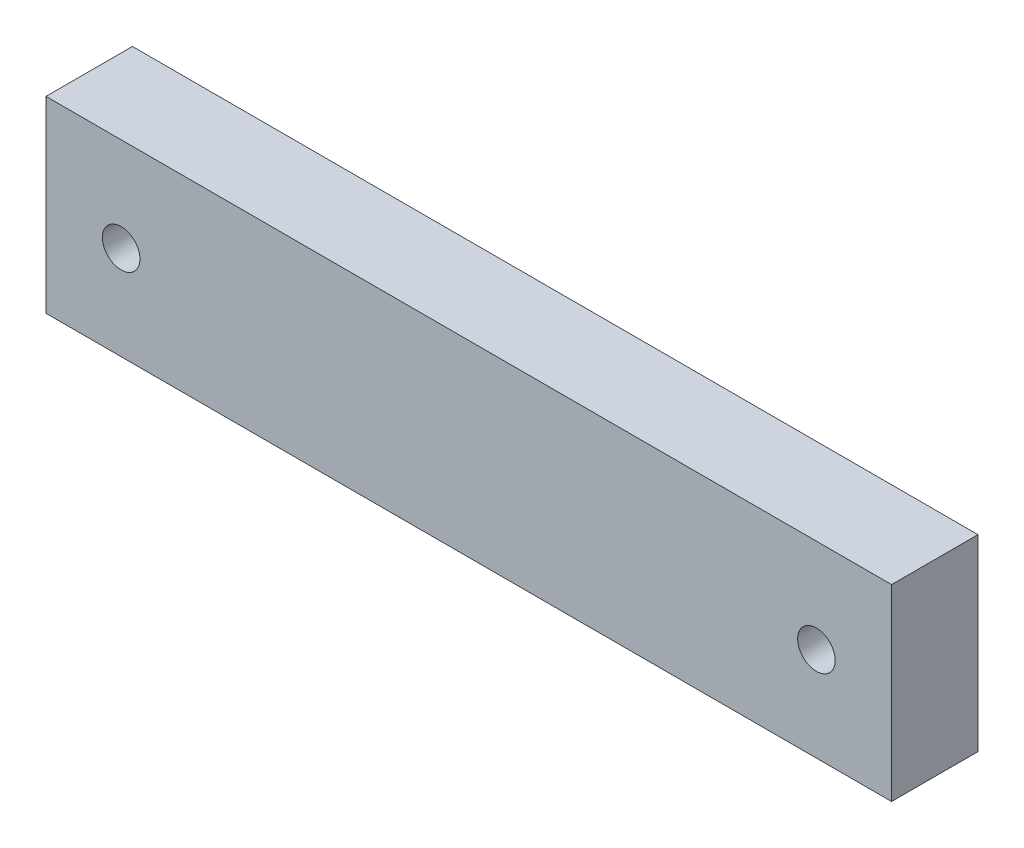
ISO-10303-21;
HEADER;
FILE_DESCRIPTION(('STEP AP214'),'2;1');
FILE_NAME('part.step','',(''),(''),'','','');
FILE_SCHEMA(('AUTOMOTIVE_DESIGN { 1 0 10303 214 1 1 1 1 }'));
ENDSEC;
DATA;
#1=APPLICATION_CONTEXT('core data for automotive mechanical design processes');
#2=APPLICATION_PROTOCOL_DEFINITION('international standard','automotive_design',2000,#1);
#3=PRODUCT_CONTEXT('',#1,'mechanical');
#4=PRODUCT('Part','Part','',(#3));
#5=PRODUCT_RELATED_PRODUCT_CATEGORY('part','',(#4));
#6=PRODUCT_DEFINITION_FORMATION('','',#4);
#7=PRODUCT_DEFINITION_CONTEXT('part definition',#1,'design');
#8=PRODUCT_DEFINITION('design','',#6,#7);
#9=PRODUCT_DEFINITION_SHAPE('','',#8);
#10=(LENGTH_UNIT() NAMED_UNIT(*) SI_UNIT(.MILLI.,.METRE.));
#11=(NAMED_UNIT(*) PLANE_ANGLE_UNIT() SI_UNIT($,.RADIAN.));
#12=(NAMED_UNIT(*) SI_UNIT($,.STERADIAN.) SOLID_ANGLE_UNIT());
#13=UNCERTAINTY_MEASURE_WITH_UNIT(LENGTH_MEASURE(1.E-05),#10,'distance_accuracy_value','');
#14=(GEOMETRIC_REPRESENTATION_CONTEXT(3) GLOBAL_UNCERTAINTY_ASSIGNED_CONTEXT((#13)) GLOBAL_UNIT_ASSIGNED_CONTEXT((#10,
#11,#12)) REPRESENTATION_CONTEXT('',''));
#15=CARTESIAN_POINT('',(0.,0.,0.));
#16=DIRECTION('',(0.,0.,1.));
#17=DIRECTION('',(1.,0.,0.));
#18=AXIS2_PLACEMENT_3D('',#15,#16,#17);
#19=CARTESIAN_POINT('',(0.,0.,23.));
#20=DIRECTION('',(0.,0.,1.));
#21=DIRECTION('',(1.,0.,0.));
#22=AXIS2_PLACEMENT_3D('',#19,#20,#21);
#23=PLANE('',#22);
#24=CARTESIAN_POINT('',(92.5,0.,23.));
#25=DIRECTION('',(0.,0.,1.));
#26=DIRECTION('',(1.,0.,0.));
#27=AXIS2_PLACEMENT_3D('',#24,#25,#26);
#28=CIRCLE('',#27,5.);
#29=CARTESIAN_POINT('',(97.5,0.,23.));
#30=VERTEX_POINT('',#29);
#31=EDGE_CURVE('E99',#30,#30,#28,.T.);
#32=ORIENTED_EDGE('',*,*,#31,.F.);
#33=EDGE_LOOP('',(#32));
#34=FACE_BOUND('',#33,.T.);
#35=DIRECTION('',(0.,1.,0.));
#36=VECTOR('',#35,1.);
#37=CARTESIAN_POINT('',(112.5,25.,23.));
#38=LINE('',#37,#36);
#39=CARTESIAN_POINT('',(112.5,-25.,23.));
#40=VERTEX_POINT('',#39);
#41=CARTESIAN_POINT('',(112.5,25.,23.));
#42=VERTEX_POINT('',#41);
#43=EDGE_CURVE('E84',#40,#42,#38,.T.);
#44=ORIENTED_EDGE('',*,*,#43,.T.);
#45=DIRECTION('',(-1.,0.,0.));
#46=VECTOR('',#45,1.);
#47=CARTESIAN_POINT('',(-112.5,25.,23.));
#48=LINE('',#47,#46);
#49=CARTESIAN_POINT('',(-112.5,25.,23.));
#50=VERTEX_POINT('',#49);
#51=EDGE_CURVE('E79',#42,#50,#48,.T.);
#52=ORIENTED_EDGE('',*,*,#51,.T.);
#53=DIRECTION('',(0.,-1.,0.));
#54=VECTOR('',#53,1.);
#55=CARTESIAN_POINT('',(-112.5,25.,23.));
#56=LINE('',#55,#54);
#57=CARTESIAN_POINT('',(-112.5,-25.,23.));
#58=VERTEX_POINT('',#57);
#59=EDGE_CURVE('E82',#50,#58,#56,.T.);
#60=ORIENTED_EDGE('',*,*,#59,.T.);
#61=DIRECTION('',(1.,0.,0.));
#62=VECTOR('',#61,1.);
#63=CARTESIAN_POINT('',(-112.5,-25.,23.));
#64=LINE('',#63,#62);
#65=EDGE_CURVE('E49',#58,#40,#64,.T.);
#66=ORIENTED_EDGE('',*,*,#65,.T.);
#67=EDGE_LOOP('',(#44,#52,#60,#66));
#68=FACE_BOUND('',#67,.T.);
#69=CARTESIAN_POINT('',(-92.5,0.,23.));
#70=DIRECTION('',(0.,0.,1.));
#71=DIRECTION('',(1.,0.,0.));
#72=AXIS2_PLACEMENT_3D('',#69,#70,#71);
#73=CIRCLE('',#72,5.);
#74=CARTESIAN_POINT('',(-87.5,0.,23.));
#75=VERTEX_POINT('',#74);
#76=EDGE_CURVE('E114',#75,#75,#73,.T.);
#77=ORIENTED_EDGE('',*,*,#76,.F.);
#78=EDGE_LOOP('',(#77));
#79=FACE_BOUND('',#78,.T.);
#80=ADVANCED_FACE('F32',(#34,#68,#79),#23,.T.);
#81=CARTESIAN_POINT('',(0.,0.,0.));
#82=DIRECTION('',(0.,0.,1.));
#83=DIRECTION('',(1.,0.,0.));
#84=AXIS2_PLACEMENT_3D('',#81,#82,#83);
#85=PLANE('',#84);
#86=CARTESIAN_POINT('',(92.5,0.,0.));
#87=DIRECTION('',(0.,0.,1.));
#88=DIRECTION('',(1.,0.,0.));
#89=AXIS2_PLACEMENT_3D('',#86,#87,#88);
#90=CIRCLE('',#89,5.);
#91=CARTESIAN_POINT('',(97.5,0.,0.));
#92=VERTEX_POINT('',#91);
#93=EDGE_CURVE('E111',#92,#92,#90,.T.);
#94=ORIENTED_EDGE('',*,*,#93,.T.);
#95=EDGE_LOOP('',(#94));
#96=FACE_BOUND('',#95,.T.);
#97=DIRECTION('',(0.,1.,0.));
#98=VECTOR('',#97,1.);
#99=CARTESIAN_POINT('',(112.5,25.,0.));
#100=LINE('',#99,#98);
#101=CARTESIAN_POINT('',(112.5,-25.,0.));
#102=VERTEX_POINT('',#101);
#103=CARTESIAN_POINT('',(112.5,25.,0.));
#104=VERTEX_POINT('',#103);
#105=EDGE_CURVE('E96',#102,#104,#100,.T.);
#106=ORIENTED_EDGE('',*,*,#105,.F.);
#107=DIRECTION('',(1.,0.,0.));
#108=VECTOR('',#107,1.);
#109=CARTESIAN_POINT('',(-112.5,-25.,0.));
#110=LINE('',#109,#108);
#111=CARTESIAN_POINT('',(-112.5,-25.,0.));
#112=VERTEX_POINT('',#111);
#113=EDGE_CURVE('E72',#112,#102,#110,.T.);
#114=ORIENTED_EDGE('',*,*,#113,.F.);
#115=DIRECTION('',(0.,-1.,0.));
#116=VECTOR('',#115,1.);
#117=CARTESIAN_POINT('',(-112.5,25.,0.));
#118=LINE('',#117,#116);
#119=CARTESIAN_POINT('',(-112.5,25.,0.));
#120=VERTEX_POINT('',#119);
#121=EDGE_CURVE('E66',#120,#112,#118,.T.);
#122=ORIENTED_EDGE('',*,*,#121,.F.);
#123=DIRECTION('',(-1.,0.,0.));
#124=VECTOR('',#123,1.);
#125=CARTESIAN_POINT('',(-112.5,25.,0.));
#126=LINE('',#125,#124);
#127=EDGE_CURVE('E88',#104,#120,#126,.T.);
#128=ORIENTED_EDGE('',*,*,#127,.F.);
#129=EDGE_LOOP('',(#106,#114,#122,#128));
#130=FACE_BOUND('',#129,.T.);
#131=CARTESIAN_POINT('',(-92.5,0.,0.));
#132=DIRECTION('',(0.,0.,1.));
#133=DIRECTION('',(1.,0.,0.));
#134=AXIS2_PLACEMENT_3D('',#131,#132,#133);
#135=CIRCLE('',#134,5.);
#136=CARTESIAN_POINT('',(-87.5,0.,0.));
#137=VERTEX_POINT('',#136);
#138=EDGE_CURVE('E117',#137,#137,#135,.T.);
#139=ORIENTED_EDGE('',*,*,#138,.T.);
#140=EDGE_LOOP('',(#139));
#141=FACE_BOUND('',#140,.T.);
#142=ADVANCED_FACE('F107',(#96,#130,#141),#85,.F.);
#143=CARTESIAN_POINT('',(112.5,25.,23.));
#144=DIRECTION('',(-1.,0.,0.));
#145=DIRECTION('',(0.,0.,1.));
#146=AXIS2_PLACEMENT_3D('',#143,#144,#145);
#147=PLANE('',#146);
#148=ORIENTED_EDGE('',*,*,#105,.T.);
#149=DIRECTION('',(0.,0.,-1.));
#150=VECTOR('',#149,1.);
#151=CARTESIAN_POINT('',(112.5,25.,23.));
#152=LINE('',#151,#150);
#153=EDGE_CURVE('E11',#42,#104,#152,.T.);
#154=ORIENTED_EDGE('',*,*,#153,.F.);
#155=ORIENTED_EDGE('',*,*,#43,.F.);
#156=DIRECTION('',(0.,0.,-1.));
#157=VECTOR('',#156,1.);
#158=CARTESIAN_POINT('',(112.5,-25.,23.));
#159=LINE('',#158,#157);
#160=EDGE_CURVE('E92',#40,#102,#159,.T.);
#161=ORIENTED_EDGE('',*,*,#160,.T.);
#162=EDGE_LOOP('',(#148,#154,#155,#161));
#163=FACE_BOUND('',#162,.T.);
#164=ADVANCED_FACE('F34',(#163),#147,.F.);
#165=CARTESIAN_POINT('',(-112.5,25.,23.));
#166=DIRECTION('',(0.,-1.,0.));
#167=DIRECTION('',(0.,0.,-1.));
#168=AXIS2_PLACEMENT_3D('',#165,#166,#167);
#169=PLANE('',#168);
#170=ORIENTED_EDGE('',*,*,#127,.T.);
#171=DIRECTION('',(0.,0.,-1.));
#172=VECTOR('',#171,1.);
#173=CARTESIAN_POINT('',(-112.5,25.,23.));
#174=LINE('',#173,#172);
#175=EDGE_CURVE('E41',#50,#120,#174,.T.);
#176=ORIENTED_EDGE('',*,*,#175,.F.);
#177=ORIENTED_EDGE('',*,*,#51,.F.);
#178=ORIENTED_EDGE('',*,*,#153,.T.);
#179=EDGE_LOOP('',(#170,#176,#177,#178));
#180=FACE_BOUND('',#179,.T.);
#181=ADVANCED_FACE('F87',(#180),#169,.F.);
#182=CARTESIAN_POINT('',(-112.5,25.,23.));
#183=DIRECTION('',(1.,0.,0.));
#184=DIRECTION('',(0.,0.,-1.));
#185=AXIS2_PLACEMENT_3D('',#182,#183,#184);
#186=PLANE('',#185);
#187=ORIENTED_EDGE('',*,*,#121,.T.);
#188=DIRECTION('',(0.,0.,-1.));
#189=VECTOR('',#188,1.);
#190=CARTESIAN_POINT('',(-112.5,-25.,23.));
#191=LINE('',#190,#189);
#192=EDGE_CURVE('E89',#58,#112,#191,.T.);
#193=ORIENTED_EDGE('',*,*,#192,.F.);
#194=ORIENTED_EDGE('',*,*,#59,.F.);
#195=ORIENTED_EDGE('',*,*,#175,.T.);
#196=EDGE_LOOP('',(#187,#193,#194,#195));
#197=FACE_BOUND('',#196,.T.);
#198=ADVANCED_FACE('F90',(#197),#186,.F.);
#199=CARTESIAN_POINT('',(-112.5,-25.,23.));
#200=DIRECTION('',(0.,1.,0.));
#201=DIRECTION('',(0.,0.,1.));
#202=AXIS2_PLACEMENT_3D('',#199,#200,#201);
#203=PLANE('',#202);
#204=ORIENTED_EDGE('',*,*,#113,.T.);
#205=ORIENTED_EDGE('',*,*,#160,.F.);
#206=ORIENTED_EDGE('',*,*,#65,.F.);
#207=ORIENTED_EDGE('',*,*,#192,.T.);
#208=EDGE_LOOP('',(#204,#205,#206,#207));
#209=FACE_BOUND('',#208,.T.);
#210=ADVANCED_FACE('F104',(#209),#203,.F.);
#211=CARTESIAN_POINT('',(92.5,0.,23.));
#212=DIRECTION('',(0.,0.,-1.));
#213=DIRECTION('',(-1.,0.,0.));
#214=AXIS2_PLACEMENT_3D('',#211,#212,#213);
#215=CYLINDRICAL_SURFACE('',#214,5.);
#216=ORIENTED_EDGE('',*,*,#31,.T.);
#217=EDGE_LOOP('',(#216));
#218=FACE_BOUND('',#217,.T.);
#219=ORIENTED_EDGE('',*,*,#93,.F.);
#220=EDGE_LOOP('',(#219));
#221=FACE_BOUND('',#220,.T.);
#222=ADVANCED_FACE('F135',(#218,#221),#215,.F.);
#223=CARTESIAN_POINT('',(-92.5,0.,23.));
#224=DIRECTION('',(0.,0.,-1.));
#225=DIRECTION('',(-1.,0.,0.));
#226=AXIS2_PLACEMENT_3D('',#223,#224,#225);
#227=CYLINDRICAL_SURFACE('',#226,5.);
#228=ORIENTED_EDGE('',*,*,#76,.T.);
#229=EDGE_LOOP('',(#228));
#230=FACE_BOUND('',#229,.T.);
#231=ORIENTED_EDGE('',*,*,#138,.F.);
#232=EDGE_LOOP('',(#231));
#233=FACE_BOUND('',#232,.T.);
#234=ADVANCED_FACE('F123',(#230,#233),#227,.F.);
#235=CLOSED_SHELL('',(#80,#142,#164,#181,#198,#210,#222,#234));
#236=MANIFOLD_SOLID_BREP('B2',#235);
#237=ADVANCED_BREP_SHAPE_REPRESENTATION('',(#18,#236),#14);
#238=SHAPE_DEFINITION_REPRESENTATION(#9,#237);
ENDSEC;
END-ISO-10303-21;
